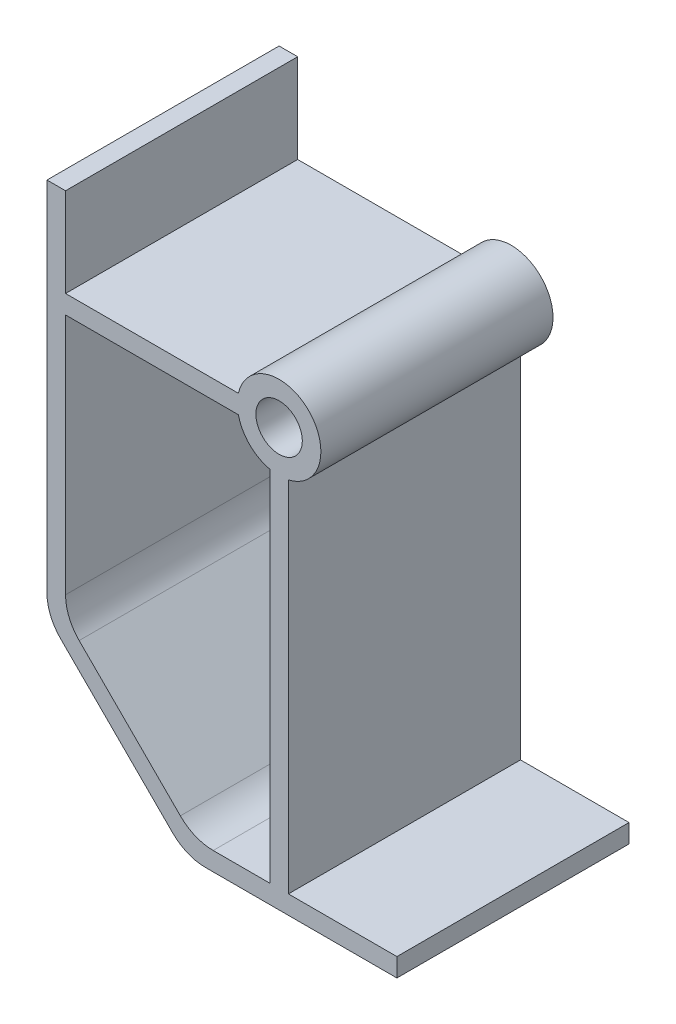
ISO-10303-21;
HEADER;
FILE_DESCRIPTION(('STEP AP214'),'2;1');
FILE_NAME('part.step','',(''),(''),'','','');
FILE_SCHEMA(('AUTOMOTIVE_DESIGN { 1 0 10303 214 1 1 1 1 }'));
ENDSEC;
DATA;
#1=APPLICATION_CONTEXT('core data for automotive mechanical design processes');
#2=APPLICATION_PROTOCOL_DEFINITION('international standard','automotive_design',2000,#1);
#3=PRODUCT_CONTEXT('',#1,'mechanical');
#4=PRODUCT('Part','Part','',(#3));
#5=PRODUCT_RELATED_PRODUCT_CATEGORY('part','',(#4));
#6=PRODUCT_DEFINITION_FORMATION('','',#4);
#7=PRODUCT_DEFINITION_CONTEXT('part definition',#1,'design');
#8=PRODUCT_DEFINITION('design','',#6,#7);
#9=PRODUCT_DEFINITION_SHAPE('','',#8);
#10=(LENGTH_UNIT() NAMED_UNIT(*) SI_UNIT(.MILLI.,.METRE.));
#11=(NAMED_UNIT(*) PLANE_ANGLE_UNIT() SI_UNIT($,.RADIAN.));
#12=(NAMED_UNIT(*) SI_UNIT($,.STERADIAN.) SOLID_ANGLE_UNIT());
#13=UNCERTAINTY_MEASURE_WITH_UNIT(LENGTH_MEASURE(1.E-05),#10,'distance_accuracy_value','');
#14=(GEOMETRIC_REPRESENTATION_CONTEXT(3) GLOBAL_UNCERTAINTY_ASSIGNED_CONTEXT((#13)) GLOBAL_UNIT_ASSIGNED_CONTEXT((#10,
#11,#12)) REPRESENTATION_CONTEXT('',''));
#15=CARTESIAN_POINT('',(0.,0.,0.));
#16=DIRECTION('',(0.,0.,1.));
#17=DIRECTION('',(1.,0.,0.));
#18=AXIS2_PLACEMENT_3D('',#15,#16,#17);
#19=CARTESIAN_POINT('',(0.,0.,25.));
#20=DIRECTION('',(0.,0.,1.));
#21=DIRECTION('',(1.,0.,0.));
#22=AXIS2_PLACEMENT_3D('',#19,#20,#21);
#23=PLANE('',#22);
#24=DIRECTION('',(0.,-1.,0.));
#25=VECTOR('',#24,1.);
#26=CARTESIAN_POINT('',(-25.,10.5839535952837,25.));
#27=LINE('',#26,#25);
#28=CARTESIAN_POINT('',(-25.,10.5839535952837,25.));
#29=VERTEX_POINT('',#28);
#30=CARTESIAN_POINT('',(-25.,-27.9289321881345,25.));
#31=VERTEX_POINT('',#30);
#32=EDGE_CURVE('E233',#29,#31,#27,.T.);
#33=ORIENTED_EDGE('',*,*,#32,.T.);
#34=CARTESIAN_POINT('',(-20.,-27.9289321881345,25.));
#35=DIRECTION('',(0.,0.,1.));
#36=DIRECTION('',(1.,0.,0.));
#37=AXIS2_PLACEMENT_3D('',#34,#35,#36);
#38=CIRCLE('',#37,5.);
#39=CARTESIAN_POINT('',(-23.5355339059327,-31.4644660940673,25.));
#40=VERTEX_POINT('',#39);
#41=EDGE_CURVE('E316',#31,#40,#38,.T.);
#42=ORIENTED_EDGE('',*,*,#41,.T.);
#43=DIRECTION('',(0.707106781186547,-0.707106781186547,0.));
#44=VECTOR('',#43,1.);
#45=CARTESIAN_POINT('',(-25.,-30.,25.));
#46=LINE('',#45,#44);
#47=CARTESIAN_POINT('',(-11.4644660940673,-43.5355339059327,25.));
#48=VERTEX_POINT('',#47);
#49=EDGE_CURVE('E237',#40,#48,#46,.T.);
#50=ORIENTED_EDGE('',*,*,#49,.T.);
#51=CARTESIAN_POINT('',(-7.92893218813452,-40.,25.));
#52=DIRECTION('',(0.,0.,1.));
#53=DIRECTION('',(1.,0.,0.));
#54=AXIS2_PLACEMENT_3D('',#51,#52,#53);
#55=CIRCLE('',#54,5.);
#56=CARTESIAN_POINT('',(-7.92893218813452,-45.,25.));
#57=VERTEX_POINT('',#56);
#58=EDGE_CURVE('E54',#48,#57,#55,.T.);
#59=ORIENTED_EDGE('',*,*,#58,.T.);
#60=DIRECTION('',(1.,0.,0.));
#61=VECTOR('',#60,1.);
#62=CARTESIAN_POINT('',(-10.,-45.,25.));
#63=LINE('',#62,#61);
#64=CARTESIAN_POINT('',(12.6870186015957,-45.,25.));
#65=VERTEX_POINT('',#64);
#66=EDGE_CURVE('E239',#57,#65,#63,.T.);
#67=ORIENTED_EDGE('',*,*,#66,.T.);
#68=DIRECTION('',(0.,1.,0.));
#69=VECTOR('',#68,1.);
#70=CARTESIAN_POINT('',(12.6870186015957,-43.,25.));
#71=LINE('',#70,#69);
#72=CARTESIAN_POINT('',(12.6870186015957,-43.,25.));
#73=VERTEX_POINT('',#72);
#74=EDGE_CURVE('E241',#65,#73,#71,.T.);
#75=ORIENTED_EDGE('',*,*,#74,.T.);
#76=DIRECTION('',(-1.,0.,0.));
#77=VECTOR('',#76,1.);
#78=CARTESIAN_POINT('',(1.,-43.,25.));
#79=LINE('',#78,#77);
#80=CARTESIAN_POINT('',(1.,-43.,25.));
#81=VERTEX_POINT('',#80);
#82=EDGE_CURVE('E243',#73,#81,#79,.T.);
#83=ORIENTED_EDGE('',*,*,#82,.T.);
#84=DIRECTION('',(0.,1.,0.));
#85=VECTOR('',#84,1.);
#86=CARTESIAN_POINT('',(1.,-4.38748219369606,25.));
#87=LINE('',#86,#85);
#88=CARTESIAN_POINT('',(1.,-4.38748219369606,25.));
#89=VERTEX_POINT('',#88);
#90=EDGE_CURVE('E245',#81,#89,#87,.T.);
#91=ORIENTED_EDGE('',*,*,#90,.T.);
#92=CARTESIAN_POINT('',(0.,0.,25.));
#93=DIRECTION('',(0.,0.,1.));
#94=DIRECTION('',(1.,0.,0.));
#95=AXIS2_PLACEMENT_3D('',#92,#93,#94);
#96=CIRCLE('',#95,4.5);
#97=CARTESIAN_POINT('',(-4.38748219369606,0.999999999999997,25.));
#98=VERTEX_POINT('',#97);
#99=EDGE_CURVE('E247',#89,#98,#96,.T.);
#100=ORIENTED_EDGE('',*,*,#99,.T.);
#101=DIRECTION('',(-1.,0.,0.));
#102=VECTOR('',#101,1.);
#103=CARTESIAN_POINT('',(-23.,1.,25.));
#104=LINE('',#103,#102);
#105=CARTESIAN_POINT('',(-23.,1.,25.));
#106=VERTEX_POINT('',#105);
#107=EDGE_CURVE('E249',#98,#106,#104,.T.);
#108=ORIENTED_EDGE('',*,*,#107,.T.);
#109=DIRECTION('',(0.,1.,0.));
#110=VECTOR('',#109,1.);
#111=CARTESIAN_POINT('',(-23.,10.5839535952837,25.));
#112=LINE('',#111,#110);
#113=CARTESIAN_POINT('',(-23.,10.5839535952837,25.));
#114=VERTEX_POINT('',#113);
#115=EDGE_CURVE('E251',#106,#114,#112,.T.);
#116=ORIENTED_EDGE('',*,*,#115,.T.);
#117=DIRECTION('',(-1.,0.,0.));
#118=VECTOR('',#117,1.);
#119=CARTESIAN_POINT('',(-25.,10.5839535952837,25.));
#120=LINE('',#119,#118);
#121=EDGE_CURVE('E230',#114,#29,#120,.T.);
#122=ORIENTED_EDGE('',*,*,#121,.T.);
#123=EDGE_LOOP('',(#33,#42,#50,#59,#67,#75,#83,#91,#100,#108,#116,#122));
#124=FACE_BOUND('',#123,.T.);
#125=CARTESIAN_POINT('',(0.,0.,25.));
#126=DIRECTION('',(0.,0.,1.));
#127=DIRECTION('',(1.,0.,0.));
#128=AXIS2_PLACEMENT_3D('',#125,#126,#127);
#129=CIRCLE('',#128,2.5);
#130=CARTESIAN_POINT('',(2.5,0.,25.));
#131=VERTEX_POINT('',#130);
#132=EDGE_CURVE('E224',#131,#131,#129,.T.);
#133=ORIENTED_EDGE('',*,*,#132,.F.);
#134=EDGE_LOOP('',(#133));
#135=FACE_BOUND('',#134,.T.);
#136=DIRECTION('',(0.707106781186547,-0.707106781186547,0.));
#137=VECTOR('',#136,1.);
#138=CARTESIAN_POINT('',(-23.,-29.1715728752538,25.));
#139=LINE('',#138,#137);
#140=CARTESIAN_POINT('',(-21.5355339059327,-30.6360389693211,25.));
#141=VERTEX_POINT('',#140);
#142=CARTESIAN_POINT('',(-10.6360389693211,-41.5355339059327,25.));
#143=VERTEX_POINT('',#142);
#144=EDGE_CURVE('E182',#141,#143,#139,.T.);
#145=ORIENTED_EDGE('',*,*,#144,.F.);
#146=CARTESIAN_POINT('',(-18.,-27.1005050633883,25.));
#147=DIRECTION('',(0.,0.,1.));
#148=DIRECTION('',(1.,0.,0.));
#149=AXIS2_PLACEMENT_3D('',#146,#147,#148);
#150=CIRCLE('',#149,5.);
#151=CARTESIAN_POINT('',(-23.,-27.1005050633883,25.));
#152=VERTEX_POINT('',#151);
#153=EDGE_CURVE('E11',#141,#152,#150,.F.);
#154=ORIENTED_EDGE('',*,*,#153,.T.);
#155=DIRECTION('',(0.,-1.,0.));
#156=VECTOR('',#155,1.);
#157=CARTESIAN_POINT('',(-23.,-1.,25.));
#158=LINE('',#157,#156);
#159=CARTESIAN_POINT('',(-23.,-1.,25.));
#160=VERTEX_POINT('',#159);
#161=EDGE_CURVE('E218',#160,#152,#158,.T.);
#162=ORIENTED_EDGE('',*,*,#161,.F.);
#163=DIRECTION('',(-1.,0.,0.));
#164=VECTOR('',#163,1.);
#165=CARTESIAN_POINT('',(-23.,-1.,25.));
#166=LINE('',#165,#164);
#167=CARTESIAN_POINT('',(-4.38748219369606,-1.,25.));
#168=VERTEX_POINT('',#167);
#169=EDGE_CURVE('E197',#168,#160,#166,.T.);
#170=ORIENTED_EDGE('',*,*,#169,.F.);
#171=CARTESIAN_POINT('',(0.,0.,25.));
#172=DIRECTION('',(0.,0.,-1.));
#173=DIRECTION('',(1.,0.,0.));
#174=AXIS2_PLACEMENT_3D('',#171,#172,#173);
#175=CIRCLE('',#174,4.5);
#176=CARTESIAN_POINT('',(-1.,-4.38748219369606,25.));
#177=VERTEX_POINT('',#176);
#178=EDGE_CURVE('E195',#177,#168,#175,.T.);
#179=ORIENTED_EDGE('',*,*,#178,.F.);
#180=DIRECTION('',(0.,1.,0.));
#181=VECTOR('',#180,1.);
#182=CARTESIAN_POINT('',(-1.,-4.38748219369606,25.));
#183=LINE('',#182,#181);
#184=CARTESIAN_POINT('',(-1.,-43.,25.));
#185=VERTEX_POINT('',#184);
#186=EDGE_CURVE('E181',#185,#177,#183,.T.);
#187=ORIENTED_EDGE('',*,*,#186,.F.);
#188=DIRECTION('',(1.,0.,0.));
#189=VECTOR('',#188,1.);
#190=CARTESIAN_POINT('',(-9.17157287525381,-43.,25.));
#191=LINE('',#190,#189);
#192=CARTESIAN_POINT('',(-7.10050506338833,-43.,25.));
#193=VERTEX_POINT('',#192);
#194=EDGE_CURVE('E171',#193,#185,#191,.T.);
#195=ORIENTED_EDGE('',*,*,#194,.F.);
#196=CARTESIAN_POINT('',(-7.10050506338833,-38.,25.));
#197=DIRECTION('',(0.,0.,1.));
#198=DIRECTION('',(1.,0.,0.));
#199=AXIS2_PLACEMENT_3D('',#196,#197,#198);
#200=CIRCLE('',#199,5.);
#201=EDGE_CURVE('E326',#193,#143,#200,.F.);
#202=ORIENTED_EDGE('',*,*,#201,.T.);
#203=EDGE_LOOP('',(#145,#154,#162,#170,#179,#187,#195,#202));
#204=FACE_BOUND('',#203,.T.);
#205=ADVANCED_FACE('F33',(#124,#135,#204),#23,.T.);
#206=CARTESIAN_POINT('',(0.,0.,0.));
#207=DIRECTION('',(0.,0.,1.));
#208=DIRECTION('',(1.,0.,0.));
#209=AXIS2_PLACEMENT_3D('',#206,#207,#208);
#210=PLANE('',#209);
#211=CARTESIAN_POINT('',(0.,0.,0.));
#212=DIRECTION('',(0.,0.,1.));
#213=DIRECTION('',(1.,0.,0.));
#214=AXIS2_PLACEMENT_3D('',#211,#212,#213);
#215=CIRCLE('',#214,2.5);
#216=CARTESIAN_POINT('',(2.5,0.,0.));
#217=VERTEX_POINT('',#216);
#218=EDGE_CURVE('E189',#217,#217,#215,.T.);
#219=ORIENTED_EDGE('',*,*,#218,.T.);
#220=EDGE_LOOP('',(#219));
#221=FACE_BOUND('',#220,.T.);
#222=DIRECTION('',(0.707106781186547,-0.707106781186547,0.));
#223=VECTOR('',#222,1.);
#224=CARTESIAN_POINT('',(-25.,-30.,0.));
#225=LINE('',#224,#223);
#226=CARTESIAN_POINT('',(-23.5355339059327,-31.4644660940673,0.));
#227=VERTEX_POINT('',#226);
#228=CARTESIAN_POINT('',(-11.4644660940673,-43.5355339059327,0.));
#229=VERTEX_POINT('',#228);
#230=EDGE_CURVE('E259',#227,#229,#225,.T.);
#231=ORIENTED_EDGE('',*,*,#230,.F.);
#232=CARTESIAN_POINT('',(-20.,-27.9289321881345,0.));
#233=DIRECTION('',(0.,0.,1.));
#234=DIRECTION('',(1.,0.,0.));
#235=AXIS2_PLACEMENT_3D('',#232,#233,#234);
#236=CIRCLE('',#235,5.);
#237=CARTESIAN_POINT('',(-25.,-27.9289321881345,0.));
#238=VERTEX_POINT('',#237);
#239=EDGE_CURVE('E311',#227,#238,#236,.F.);
#240=ORIENTED_EDGE('',*,*,#239,.T.);
#241=DIRECTION('',(0.,-1.,0.));
#242=VECTOR('',#241,1.);
#243=CARTESIAN_POINT('',(-25.,10.5839535952837,0.));
#244=LINE('',#243,#242);
#245=CARTESIAN_POINT('',(-25.,10.5839535952837,0.));
#246=VERTEX_POINT('',#245);
#247=EDGE_CURVE('E256',#246,#238,#244,.T.);
#248=ORIENTED_EDGE('',*,*,#247,.F.);
#249=DIRECTION('',(-1.,0.,0.));
#250=VECTOR('',#249,1.);
#251=CARTESIAN_POINT('',(-25.,10.5839535952837,0.));
#252=LINE('',#251,#250);
#253=CARTESIAN_POINT('',(-23.,10.5839535952837,0.));
#254=VERTEX_POINT('',#253);
#255=EDGE_CURVE('E227',#254,#246,#252,.T.);
#256=ORIENTED_EDGE('',*,*,#255,.F.);
#257=DIRECTION('',(0.,1.,0.));
#258=VECTOR('',#257,1.);
#259=CARTESIAN_POINT('',(-23.,10.5839535952837,0.));
#260=LINE('',#259,#258);
#261=CARTESIAN_POINT('',(-23.,1.,0.));
#262=VERTEX_POINT('',#261);
#263=EDGE_CURVE('E234',#262,#254,#260,.T.);
#264=ORIENTED_EDGE('',*,*,#263,.F.);
#265=DIRECTION('',(-1.,0.,0.));
#266=VECTOR('',#265,1.);
#267=CARTESIAN_POINT('',(-23.,1.,0.));
#268=LINE('',#267,#266);
#269=CARTESIAN_POINT('',(-4.38748219369606,0.999999999999997,0.));
#270=VERTEX_POINT('',#269);
#271=EDGE_CURVE('E272',#270,#262,#268,.T.);
#272=ORIENTED_EDGE('',*,*,#271,.F.);
#273=CARTESIAN_POINT('',(0.,0.,0.));
#274=DIRECTION('',(0.,0.,1.));
#275=DIRECTION('',(1.,0.,0.));
#276=AXIS2_PLACEMENT_3D('',#273,#274,#275);
#277=CIRCLE('',#276,4.5);
#278=CARTESIAN_POINT('',(1.,-4.38748219369606,0.));
#279=VERTEX_POINT('',#278);
#280=EDGE_CURVE('E270',#279,#270,#277,.T.);
#281=ORIENTED_EDGE('',*,*,#280,.F.);
#282=DIRECTION('',(0.,1.,0.));
#283=VECTOR('',#282,1.);
#284=CARTESIAN_POINT('',(1.,-4.38748219369606,0.));
#285=LINE('',#284,#283);
#286=CARTESIAN_POINT('',(1.,-43.,0.));
#287=VERTEX_POINT('',#286);
#288=EDGE_CURVE('E268',#287,#279,#285,.T.);
#289=ORIENTED_EDGE('',*,*,#288,.F.);
#290=DIRECTION('',(-1.,0.,0.));
#291=VECTOR('',#290,1.);
#292=CARTESIAN_POINT('',(1.,-43.,0.));
#293=LINE('',#292,#291);
#294=CARTESIAN_POINT('',(12.6870186015957,-43.,0.));
#295=VERTEX_POINT('',#294);
#296=EDGE_CURVE('E266',#295,#287,#293,.T.);
#297=ORIENTED_EDGE('',*,*,#296,.F.);
#298=DIRECTION('',(0.,1.,0.));
#299=VECTOR('',#298,1.);
#300=CARTESIAN_POINT('',(12.6870186015957,-43.,0.));
#301=LINE('',#300,#299);
#302=CARTESIAN_POINT('',(12.6870186015957,-45.,0.));
#303=VERTEX_POINT('',#302);
#304=EDGE_CURVE('E264',#303,#295,#301,.T.);
#305=ORIENTED_EDGE('',*,*,#304,.F.);
#306=DIRECTION('',(1.,0.,0.));
#307=VECTOR('',#306,1.);
#308=CARTESIAN_POINT('',(-10.,-45.,0.));
#309=LINE('',#308,#307);
#310=CARTESIAN_POINT('',(-7.92893218813452,-45.,0.));
#311=VERTEX_POINT('',#310);
#312=EDGE_CURVE('E262',#311,#303,#309,.T.);
#313=ORIENTED_EDGE('',*,*,#312,.F.);
#314=CARTESIAN_POINT('',(-7.92893218813452,-40.,0.));
#315=DIRECTION('',(0.,0.,1.));
#316=DIRECTION('',(1.,0.,0.));
#317=AXIS2_PLACEMENT_3D('',#314,#315,#316);
#318=CIRCLE('',#317,5.);
#319=EDGE_CURVE('E309',#311,#229,#318,.F.);
#320=ORIENTED_EDGE('',*,*,#319,.T.);
#321=EDGE_LOOP('',(#231,#240,#248,#256,#264,#272,#281,#289,#297,#305,#313,#320));
#322=FACE_BOUND('',#321,.T.);
#323=DIRECTION('',(0.,-1.,0.));
#324=VECTOR('',#323,1.);
#325=CARTESIAN_POINT('',(-23.,-1.,0.));
#326=LINE('',#325,#324);
#327=CARTESIAN_POINT('',(-23.,-1.,0.));
#328=VERTEX_POINT('',#327);
#329=CARTESIAN_POINT('',(-23.,-27.1005050633883,0.));
#330=VERTEX_POINT('',#329);
#331=EDGE_CURVE('E203',#328,#330,#326,.T.);
#332=ORIENTED_EDGE('',*,*,#331,.T.);
#333=CARTESIAN_POINT('',(-18.,-27.1005050633883,0.));
#334=DIRECTION('',(0.,0.,1.));
#335=DIRECTION('',(1.,0.,0.));
#336=AXIS2_PLACEMENT_3D('',#333,#334,#335);
#337=CIRCLE('',#336,5.);
#338=CARTESIAN_POINT('',(-21.5355339059327,-30.6360389693211,0.));
#339=VERTEX_POINT('',#338);
#340=EDGE_CURVE('E41',#330,#339,#337,.T.);
#341=ORIENTED_EDGE('',*,*,#340,.T.);
#342=DIRECTION('',(0.707106781186547,-0.707106781186547,0.));
#343=VECTOR('',#342,1.);
#344=CARTESIAN_POINT('',(-23.,-29.1715728752538,0.));
#345=LINE('',#344,#343);
#346=CARTESIAN_POINT('',(-10.6360389693211,-41.5355339059327,0.));
#347=VERTEX_POINT('',#346);
#348=EDGE_CURVE('E206',#339,#347,#345,.T.);
#349=ORIENTED_EDGE('',*,*,#348,.T.);
#350=CARTESIAN_POINT('',(-7.10050506338833,-38.,0.));
#351=DIRECTION('',(0.,0.,1.));
#352=DIRECTION('',(1.,0.,0.));
#353=AXIS2_PLACEMENT_3D('',#350,#351,#352);
#354=CIRCLE('',#353,5.);
#355=CARTESIAN_POINT('',(-7.10050506338833,-43.,0.));
#356=VERTEX_POINT('',#355);
#357=EDGE_CURVE('E324',#347,#356,#354,.T.);
#358=ORIENTED_EDGE('',*,*,#357,.T.);
#359=DIRECTION('',(1.,0.,0.));
#360=VECTOR('',#359,1.);
#361=CARTESIAN_POINT('',(-9.17157287525381,-43.,0.));
#362=LINE('',#361,#360);
#363=CARTESIAN_POINT('',(-1.,-43.,0.));
#364=VERTEX_POINT('',#363);
#365=EDGE_CURVE('E209',#356,#364,#362,.T.);
#366=ORIENTED_EDGE('',*,*,#365,.T.);
#367=DIRECTION('',(0.,1.,0.));
#368=VECTOR('',#367,1.);
#369=CARTESIAN_POINT('',(-1.,-4.38748219369606,0.));
#370=LINE('',#369,#368);
#371=CARTESIAN_POINT('',(-1.,-4.38748219369606,0.));
#372=VERTEX_POINT('',#371);
#373=EDGE_CURVE('E188',#364,#372,#370,.T.);
#374=ORIENTED_EDGE('',*,*,#373,.T.);
#375=CARTESIAN_POINT('',(0.,0.,0.));
#376=DIRECTION('',(0.,0.,-1.));
#377=DIRECTION('',(1.,0.,0.));
#378=AXIS2_PLACEMENT_3D('',#375,#376,#377);
#379=CIRCLE('',#378,4.5);
#380=CARTESIAN_POINT('',(-4.38748219369606,-1.,0.));
#381=VERTEX_POINT('',#380);
#382=EDGE_CURVE('E212',#372,#381,#379,.T.);
#383=ORIENTED_EDGE('',*,*,#382,.T.);
#384=DIRECTION('',(-1.,0.,0.));
#385=VECTOR('',#384,1.);
#386=CARTESIAN_POINT('',(-23.,-1.,0.));
#387=LINE('',#386,#385);
#388=EDGE_CURVE('E215',#381,#328,#387,.T.);
#389=ORIENTED_EDGE('',*,*,#388,.T.);
#390=EDGE_LOOP('',(#332,#341,#349,#358,#366,#374,#383,#389));
#391=FACE_BOUND('',#390,.T.);
#392=ADVANCED_FACE('F329',(#221,#322,#391),#210,.F.);
#393=CARTESIAN_POINT('',(-25.,10.5839535952837,25.));
#394=DIRECTION('',(0.,-1.,0.));
#395=DIRECTION('',(0.,0.,-1.));
#396=AXIS2_PLACEMENT_3D('',#393,#394,#395);
#397=PLANE('',#396);
#398=ORIENTED_EDGE('',*,*,#255,.T.);
#399=DIRECTION('',(0.,0.,-1.));
#400=VECTOR('',#399,1.);
#401=CARTESIAN_POINT('',(-25.,10.5839535952837,25.));
#402=LINE('',#401,#400);
#403=EDGE_CURVE('E295',#29,#246,#402,.T.);
#404=ORIENTED_EDGE('',*,*,#403,.F.);
#405=ORIENTED_EDGE('',*,*,#121,.F.);
#406=DIRECTION('',(0.,0.,-1.));
#407=VECTOR('',#406,1.);
#408=CARTESIAN_POINT('',(-23.,10.5839535952837,25.));
#409=LINE('',#408,#407);
#410=EDGE_CURVE('E253',#114,#254,#409,.T.);
#411=ORIENTED_EDGE('',*,*,#410,.T.);
#412=EDGE_LOOP('',(#398,#404,#405,#411));
#413=FACE_BOUND('',#412,.T.);
#414=ADVANCED_FACE('F364',(#413),#397,.F.);
#415=CARTESIAN_POINT('',(-25.,10.5839535952837,25.));
#416=DIRECTION('',(1.,0.,0.));
#417=DIRECTION('',(0.,0.,-1.));
#418=AXIS2_PLACEMENT_3D('',#415,#416,#417);
#419=PLANE('',#418);
#420=ORIENTED_EDGE('',*,*,#247,.T.);
#421=DIRECTION('',(0.,0.,-1.));
#422=VECTOR('',#421,1.);
#423=CARTESIAN_POINT('',(-25.,-27.9289321881345,25.));
#424=LINE('',#423,#422);
#425=EDGE_CURVE('E313',#238,#31,#424,.F.);
#426=ORIENTED_EDGE('',*,*,#425,.T.);
#427=ORIENTED_EDGE('',*,*,#32,.F.);
#428=ORIENTED_EDGE('',*,*,#403,.T.);
#429=EDGE_LOOP('',(#420,#426,#427,#428));
#430=FACE_BOUND('',#429,.T.);
#431=ADVANCED_FACE('F403',(#430),#419,.F.);
#432=CARTESIAN_POINT('',(-25.,-30.,25.));
#433=DIRECTION('',(0.707106781186547,0.707106781186547,0.));
#434=DIRECTION('',(-0.707106781186548,0.707106781186548,0.));
#435=AXIS2_PLACEMENT_3D('',#432,#433,#434);
#436=PLANE('',#435);
#437=ORIENTED_EDGE('',*,*,#49,.F.);
#438=DIRECTION('',(0.,0.,-1.));
#439=VECTOR('',#438,1.);
#440=CARTESIAN_POINT('',(-23.5355339059327,-31.4644660940673,25.));
#441=LINE('',#440,#439);
#442=EDGE_CURVE('E306',#40,#227,#441,.T.);
#443=ORIENTED_EDGE('',*,*,#442,.T.);
#444=ORIENTED_EDGE('',*,*,#230,.T.);
#445=DIRECTION('',(0.,0.,-1.));
#446=VECTOR('',#445,1.);
#447=CARTESIAN_POINT('',(-11.4644660940673,-43.5355339059327,25.));
#448=LINE('',#447,#446);
#449=EDGE_CURVE('E304',#229,#48,#448,.F.);
#450=ORIENTED_EDGE('',*,*,#449,.T.);
#451=EDGE_LOOP('',(#437,#443,#444,#450));
#452=FACE_BOUND('',#451,.T.);
#453=ADVANCED_FACE('F399',(#452),#436,.F.);
#454=CARTESIAN_POINT('',(-10.,-45.,25.));
#455=DIRECTION('',(0.,1.,0.));
#456=DIRECTION('',(0.,0.,1.));
#457=AXIS2_PLACEMENT_3D('',#454,#455,#456);
#458=PLANE('',#457);
#459=ORIENTED_EDGE('',*,*,#66,.F.);
#460=DIRECTION('',(0.,0.,-1.));
#461=VECTOR('',#460,1.);
#462=CARTESIAN_POINT('',(-7.92893218813452,-45.,25.));
#463=LINE('',#462,#461);
#464=EDGE_CURVE('E321',#57,#311,#463,.T.);
#465=ORIENTED_EDGE('',*,*,#464,.T.);
#466=ORIENTED_EDGE('',*,*,#312,.T.);
#467=DIRECTION('',(0.,0.,-1.));
#468=VECTOR('',#467,1.);
#469=CARTESIAN_POINT('',(12.6870186015957,-45.,25.));
#470=LINE('',#469,#468);
#471=EDGE_CURVE('E292',#65,#303,#470,.T.);
#472=ORIENTED_EDGE('',*,*,#471,.F.);
#473=EDGE_LOOP('',(#459,#465,#466,#472));
#474=FACE_BOUND('',#473,.T.);
#475=ADVANCED_FACE('F395',(#474),#458,.F.);
#476=CARTESIAN_POINT('',(12.6870186015957,-43.,25.));
#477=DIRECTION('',(-1.,0.,0.));
#478=DIRECTION('',(0.,-1.,0.));
#479=AXIS2_PLACEMENT_3D('',#476,#477,#478);
#480=PLANE('',#479);
#481=ORIENTED_EDGE('',*,*,#304,.T.);
#482=DIRECTION('',(0.,0.,-1.));
#483=VECTOR('',#482,1.);
#484=CARTESIAN_POINT('',(12.6870186015957,-43.,25.));
#485=LINE('',#484,#483);
#486=EDGE_CURVE('E289',#73,#295,#485,.T.);
#487=ORIENTED_EDGE('',*,*,#486,.F.);
#488=ORIENTED_EDGE('',*,*,#74,.F.);
#489=ORIENTED_EDGE('',*,*,#471,.T.);
#490=EDGE_LOOP('',(#481,#487,#488,#489));
#491=FACE_BOUND('',#490,.T.);
#492=ADVANCED_FACE('F391',(#491),#480,.F.);
#493=CARTESIAN_POINT('',(1.,-43.,25.));
#494=DIRECTION('',(0.,-1.,0.));
#495=DIRECTION('',(0.,0.,-1.));
#496=AXIS2_PLACEMENT_3D('',#493,#494,#495);
#497=PLANE('',#496);
#498=ORIENTED_EDGE('',*,*,#296,.T.);
#499=DIRECTION('',(0.,0.,-1.));
#500=VECTOR('',#499,1.);
#501=CARTESIAN_POINT('',(1.,-43.,25.));
#502=LINE('',#501,#500);
#503=EDGE_CURVE('E286',#81,#287,#502,.T.);
#504=ORIENTED_EDGE('',*,*,#503,.F.);
#505=ORIENTED_EDGE('',*,*,#82,.F.);
#506=ORIENTED_EDGE('',*,*,#486,.T.);
#507=EDGE_LOOP('',(#498,#504,#505,#506));
#508=FACE_BOUND('',#507,.T.);
#509=ADVANCED_FACE('F387',(#508),#497,.F.);
#510=CARTESIAN_POINT('',(1.,-4.38748219369606,25.));
#511=DIRECTION('',(-1.,0.,0.));
#512=DIRECTION('',(0.,0.,1.));
#513=AXIS2_PLACEMENT_3D('',#510,#511,#512);
#514=PLANE('',#513);
#515=ORIENTED_EDGE('',*,*,#288,.T.);
#516=DIRECTION('',(0.,0.,-1.));
#517=VECTOR('',#516,1.);
#518=CARTESIAN_POINT('',(1.,-4.38748219369606,25.));
#519=LINE('',#518,#517);
#520=EDGE_CURVE('E283',#89,#279,#519,.T.);
#521=ORIENTED_EDGE('',*,*,#520,.F.);
#522=ORIENTED_EDGE('',*,*,#90,.F.);
#523=ORIENTED_EDGE('',*,*,#503,.T.);
#524=EDGE_LOOP('',(#515,#521,#522,#523));
#525=FACE_BOUND('',#524,.T.);
#526=ADVANCED_FACE('F383',(#525),#514,.F.);
#527=CARTESIAN_POINT('',(0.,0.,25.));
#528=DIRECTION('',(0.,0.,-1.));
#529=DIRECTION('',(-1.,0.,0.));
#530=AXIS2_PLACEMENT_3D('',#527,#528,#529);
#531=CYLINDRICAL_SURFACE('',#530,4.5);
#532=ORIENTED_EDGE('',*,*,#280,.T.);
#533=DIRECTION('',(0.,0.,-1.));
#534=VECTOR('',#533,1.);
#535=CARTESIAN_POINT('',(-4.38748219369606,0.999999999999997,25.));
#536=LINE('',#535,#534);
#537=EDGE_CURVE('E280',#98,#270,#536,.T.);
#538=ORIENTED_EDGE('',*,*,#537,.F.);
#539=ORIENTED_EDGE('',*,*,#99,.F.);
#540=ORIENTED_EDGE('',*,*,#520,.T.);
#541=EDGE_LOOP('',(#532,#538,#539,#540));
#542=FACE_BOUND('',#541,.T.);
#543=ADVANCED_FACE('F379',(#542),#531,.T.);
#544=CARTESIAN_POINT('',(-23.,1.,25.));
#545=DIRECTION('',(0.,-1.,0.));
#546=DIRECTION('',(1.,0.,0.));
#547=AXIS2_PLACEMENT_3D('',#544,#545,#546);
#548=PLANE('',#547);
#549=ORIENTED_EDGE('',*,*,#271,.T.);
#550=DIRECTION('',(0.,0.,-1.));
#551=VECTOR('',#550,1.);
#552=CARTESIAN_POINT('',(-23.,1.,25.));
#553=LINE('',#552,#551);
#554=EDGE_CURVE('E277',#106,#262,#553,.T.);
#555=ORIENTED_EDGE('',*,*,#554,.F.);
#556=ORIENTED_EDGE('',*,*,#107,.F.);
#557=ORIENTED_EDGE('',*,*,#537,.T.);
#558=EDGE_LOOP('',(#549,#555,#556,#557));
#559=FACE_BOUND('',#558,.T.);
#560=ADVANCED_FACE('F375',(#559),#548,.F.);
#561=CARTESIAN_POINT('',(-23.,10.5839535952837,25.));
#562=DIRECTION('',(-1.,0.,0.));
#563=DIRECTION('',(0.,0.,1.));
#564=AXIS2_PLACEMENT_3D('',#561,#562,#563);
#565=PLANE('',#564);
#566=ORIENTED_EDGE('',*,*,#263,.T.);
#567=ORIENTED_EDGE('',*,*,#410,.F.);
#568=ORIENTED_EDGE('',*,*,#115,.F.);
#569=ORIENTED_EDGE('',*,*,#554,.T.);
#570=EDGE_LOOP('',(#566,#567,#568,#569));
#571=FACE_BOUND('',#570,.T.);
#572=ADVANCED_FACE('F372',(#571),#565,.F.);
#573=CARTESIAN_POINT('',(0.,0.,25.));
#574=DIRECTION('',(0.,0.,-1.));
#575=DIRECTION('',(-1.,0.,0.));
#576=AXIS2_PLACEMENT_3D('',#573,#574,#575);
#577=CYLINDRICAL_SURFACE('',#576,2.5);
#578=ORIENTED_EDGE('',*,*,#132,.T.);
#579=EDGE_LOOP('',(#578));
#580=FACE_BOUND('',#579,.T.);
#581=ORIENTED_EDGE('',*,*,#218,.F.);
#582=EDGE_LOOP('',(#581));
#583=FACE_BOUND('',#582,.T.);
#584=ADVANCED_FACE('F369',(#580,#583),#577,.F.);
#585=CARTESIAN_POINT('',(-23.,-1.,25.));
#586=DIRECTION('',(1.,0.,0.));
#587=DIRECTION('',(0.,0.,-1.));
#588=AXIS2_PLACEMENT_3D('',#585,#586,#587);
#589=PLANE('',#588);
#590=ORIENTED_EDGE('',*,*,#161,.T.);
#591=DIRECTION('',(0.,0.,-1.));
#592=VECTOR('',#591,1.);
#593=CARTESIAN_POINT('',(-23.,-27.1005050633883,0.));
#594=LINE('',#593,#592);
#595=EDGE_CURVE('E318',#152,#330,#594,.T.);
#596=ORIENTED_EDGE('',*,*,#595,.T.);
#597=ORIENTED_EDGE('',*,*,#331,.F.);
#598=DIRECTION('',(0.,0.,-1.));
#599=VECTOR('',#598,1.);
#600=CARTESIAN_POINT('',(-23.,-1.,25.));
#601=LINE('',#600,#599);
#602=EDGE_CURVE('E202',#160,#328,#601,.T.);
#603=ORIENTED_EDGE('',*,*,#602,.F.);
#604=EDGE_LOOP('',(#590,#596,#597,#603));
#605=FACE_BOUND('',#604,.T.);
#606=ADVANCED_FACE('F339',(#605),#589,.T.);
#607=CARTESIAN_POINT('',(-23.,-29.1715728752538,25.));
#608=DIRECTION('',(0.707106781186547,0.707106781186547,0.));
#609=DIRECTION('',(-0.707106781186548,0.707106781186548,0.));
#610=AXIS2_PLACEMENT_3D('',#607,#608,#609);
#611=PLANE('',#610);
#612=ORIENTED_EDGE('',*,*,#144,.T.);
#613=DIRECTION('',(0.,0.,-1.));
#614=VECTOR('',#613,1.);
#615=CARTESIAN_POINT('',(-10.6360389693211,-41.5355339059327,0.));
#616=LINE('',#615,#614);
#617=EDGE_CURVE('E300',#143,#347,#616,.T.);
#618=ORIENTED_EDGE('',*,*,#617,.T.);
#619=ORIENTED_EDGE('',*,*,#348,.F.);
#620=DIRECTION('',(0.,0.,-1.));
#621=VECTOR('',#620,1.);
#622=CARTESIAN_POINT('',(-21.5355339059327,-30.6360389693211,25.));
#623=LINE('',#622,#621);
#624=EDGE_CURVE('E298',#339,#141,#623,.F.);
#625=ORIENTED_EDGE('',*,*,#624,.T.);
#626=EDGE_LOOP('',(#612,#618,#619,#625));
#627=FACE_BOUND('',#626,.T.);
#628=ADVANCED_FACE('F335',(#627),#611,.T.);
#629=CARTESIAN_POINT('',(-9.17157287525381,-43.,25.));
#630=DIRECTION('',(0.,1.,0.));
#631=DIRECTION('',(0.,0.,1.));
#632=AXIS2_PLACEMENT_3D('',#629,#630,#631);
#633=PLANE('',#632);
#634=ORIENTED_EDGE('',*,*,#365,.F.);
#635=DIRECTION('',(0.,0.,-1.));
#636=VECTOR('',#635,1.);
#637=CARTESIAN_POINT('',(-7.10050506338833,-43.,25.));
#638=LINE('',#637,#636);
#639=EDGE_CURVE('E178',#356,#193,#638,.F.);
#640=ORIENTED_EDGE('',*,*,#639,.T.);
#641=ORIENTED_EDGE('',*,*,#194,.T.);
#642=DIRECTION('',(0.,0.,-1.));
#643=VECTOR('',#642,1.);
#644=CARTESIAN_POINT('',(-1.,-43.,25.));
#645=LINE('',#644,#643);
#646=EDGE_CURVE('E175',#185,#364,#645,.T.);
#647=ORIENTED_EDGE('',*,*,#646,.T.);
#648=EDGE_LOOP('',(#634,#640,#641,#647));
#649=FACE_BOUND('',#648,.T.);
#650=ADVANCED_FACE('F174',(#649),#633,.T.);
#651=CARTESIAN_POINT('',(-1.,-4.38748219369606,25.));
#652=DIRECTION('',(-1.,0.,0.));
#653=DIRECTION('',(0.,-1.,0.));
#654=AXIS2_PLACEMENT_3D('',#651,#652,#653);
#655=PLANE('',#654);
#656=ORIENTED_EDGE('',*,*,#373,.F.);
#657=ORIENTED_EDGE('',*,*,#646,.F.);
#658=ORIENTED_EDGE('',*,*,#186,.T.);
#659=DIRECTION('',(0.,0.,-1.));
#660=VECTOR('',#659,1.);
#661=CARTESIAN_POINT('',(-1.,-4.38748219369606,25.));
#662=LINE('',#661,#660);
#663=EDGE_CURVE('E190',#177,#372,#662,.T.);
#664=ORIENTED_EDGE('',*,*,#663,.T.);
#665=EDGE_LOOP('',(#656,#657,#658,#664));
#666=FACE_BOUND('',#665,.T.);
#667=ADVANCED_FACE('F185',(#666),#655,.T.);
#668=CARTESIAN_POINT('',(0.,0.,25.));
#669=DIRECTION('',(0.,0.,-1.));
#670=DIRECTION('',(-1.,0.,0.));
#671=AXIS2_PLACEMENT_3D('',#668,#669,#670);
#672=CYLINDRICAL_SURFACE('',#671,4.5);
#673=ORIENTED_EDGE('',*,*,#382,.F.);
#674=ORIENTED_EDGE('',*,*,#663,.F.);
#675=ORIENTED_EDGE('',*,*,#178,.T.);
#676=DIRECTION('',(0.,0.,-1.));
#677=VECTOR('',#676,1.);
#678=CARTESIAN_POINT('',(-4.38748219369606,-1.,25.));
#679=LINE('',#678,#677);
#680=EDGE_CURVE('E221',#168,#381,#679,.T.);
#681=ORIENTED_EDGE('',*,*,#680,.T.);
#682=EDGE_LOOP('',(#673,#674,#675,#681));
#683=FACE_BOUND('',#682,.T.);
#684=ADVANCED_FACE('F347',(#683),#672,.T.);
#685=CARTESIAN_POINT('',(-23.,-1.,25.));
#686=DIRECTION('',(0.,-1.,0.));
#687=DIRECTION('',(1.,0.,0.));
#688=AXIS2_PLACEMENT_3D('',#685,#686,#687);
#689=PLANE('',#688);
#690=ORIENTED_EDGE('',*,*,#388,.F.);
#691=ORIENTED_EDGE('',*,*,#680,.F.);
#692=ORIENTED_EDGE('',*,*,#169,.T.);
#693=ORIENTED_EDGE('',*,*,#602,.T.);
#694=EDGE_LOOP('',(#690,#691,#692,#693));
#695=FACE_BOUND('',#694,.T.);
#696=ADVANCED_FACE('F349',(#695),#689,.T.);
#697=CARTESIAN_POINT('',(-7.10050506338833,-38.,25.));
#698=DIRECTION('',(0.,0.,1.));
#699=DIRECTION('',(1.,0.,0.));
#700=AXIS2_PLACEMENT_3D('',#697,#698,#699);
#701=CYLINDRICAL_SURFACE('',#700,5.);
#702=ORIENTED_EDGE('',*,*,#201,.F.);
#703=ORIENTED_EDGE('',*,*,#639,.F.);
#704=ORIENTED_EDGE('',*,*,#357,.F.);
#705=ORIENTED_EDGE('',*,*,#617,.F.);
#706=EDGE_LOOP('',(#702,#703,#704,#705));
#707=FACE_BOUND('',#706,.T.);
#708=ADVANCED_FACE('F343',(#707),#701,.F.);
#709=CARTESIAN_POINT('',(-20.,-27.9289321881345,25.));
#710=DIRECTION('',(0.,0.,-1.));
#711=DIRECTION('',(-1.,0.,0.));
#712=AXIS2_PLACEMENT_3D('',#709,#710,#711);
#713=CYLINDRICAL_SURFACE('',#712,5.);
#714=ORIENTED_EDGE('',*,*,#41,.F.);
#715=ORIENTED_EDGE('',*,*,#425,.F.);
#716=ORIENTED_EDGE('',*,*,#239,.F.);
#717=ORIENTED_EDGE('',*,*,#442,.F.);
#718=EDGE_LOOP('',(#714,#715,#716,#717));
#719=FACE_BOUND('',#718,.T.);
#720=ADVANCED_FACE('F356',(#719),#713,.T.);
#721=CARTESIAN_POINT('',(-18.,-27.1005050633883,25.));
#722=DIRECTION('',(0.,0.,1.));
#723=DIRECTION('',(1.,0.,0.));
#724=AXIS2_PLACEMENT_3D('',#721,#722,#723);
#725=CYLINDRICAL_SURFACE('',#724,5.);
#726=ORIENTED_EDGE('',*,*,#153,.F.);
#727=ORIENTED_EDGE('',*,*,#624,.F.);
#728=ORIENTED_EDGE('',*,*,#340,.F.);
#729=ORIENTED_EDGE('',*,*,#595,.F.);
#730=EDGE_LOOP('',(#726,#727,#728,#729));
#731=FACE_BOUND('',#730,.T.);
#732=ADVANCED_FACE('F337',(#731),#725,.F.);
#733=CARTESIAN_POINT('',(-7.92893218813452,-40.,25.));
#734=DIRECTION('',(0.,0.,-1.));
#735=DIRECTION('',(-1.,0.,0.));
#736=AXIS2_PLACEMENT_3D('',#733,#734,#735);
#737=CYLINDRICAL_SURFACE('',#736,5.);
#738=ORIENTED_EDGE('',*,*,#58,.F.);
#739=ORIENTED_EDGE('',*,*,#449,.F.);
#740=ORIENTED_EDGE('',*,*,#319,.F.);
#741=ORIENTED_EDGE('',*,*,#464,.F.);
#742=EDGE_LOOP('',(#738,#739,#740,#741));
#743=FACE_BOUND('',#742,.T.);
#744=ADVANCED_FACE('F35',(#743),#737,.T.);
#745=CLOSED_SHELL('',(#205,#392,#414,#431,#453,#475,#492,#509,#526,#543,#560,#572,#584,#606,
#628,#650,#667,#684,#696,#708,#720,#732,#744));
#746=MANIFOLD_SOLID_BREP('B2',#745);
#747=ADVANCED_BREP_SHAPE_REPRESENTATION('',(#18,#746),#14);
#748=SHAPE_DEFINITION_REPRESENTATION(#9,#747);
ENDSEC;
END-ISO-10303-21;
